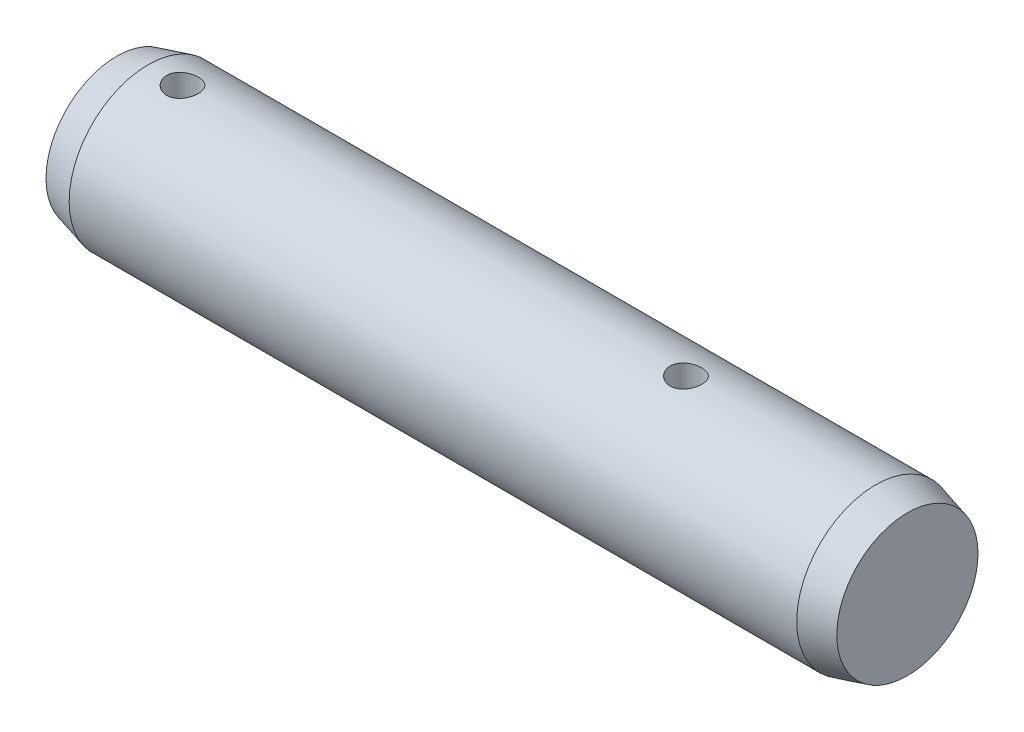
ISO-10303-21;
HEADER;
FILE_DESCRIPTION(('STEP AP214'),'2;1');
FILE_NAME('part.step','',(''),(''),'','','');
FILE_SCHEMA(('AUTOMOTIVE_DESIGN { 1 0 10303 214 1 1 1 1 }'));
ENDSEC;
DATA;
#1=APPLICATION_CONTEXT('core data for automotive mechanical design processes');
#2=APPLICATION_PROTOCOL_DEFINITION('international standard','automotive_design',2000,#1);
#3=PRODUCT_CONTEXT('',#1,'mechanical');
#4=PRODUCT('Part','Part','',(#3));
#5=PRODUCT_RELATED_PRODUCT_CATEGORY('part','',(#4));
#6=PRODUCT_DEFINITION_FORMATION('','',#4);
#7=PRODUCT_DEFINITION_CONTEXT('part definition',#1,'design');
#8=PRODUCT_DEFINITION('design','',#6,#7);
#9=PRODUCT_DEFINITION_SHAPE('','',#8);
#10=(LENGTH_UNIT() NAMED_UNIT(*) SI_UNIT(.MILLI.,.METRE.));
#11=(NAMED_UNIT(*) PLANE_ANGLE_UNIT() SI_UNIT($,.RADIAN.));
#12=(NAMED_UNIT(*) SI_UNIT($,.STERADIAN.) SOLID_ANGLE_UNIT());
#13=UNCERTAINTY_MEASURE_WITH_UNIT(LENGTH_MEASURE(1.E-05),#10,'distance_accuracy_value','');
#14=(GEOMETRIC_REPRESENTATION_CONTEXT(3) GLOBAL_UNCERTAINTY_ASSIGNED_CONTEXT((#13)) GLOBAL_UNIT_ASSIGNED_CONTEXT((#10,
#11,#12)) REPRESENTATION_CONTEXT('',''));
#15=CARTESIAN_POINT('',(0.,0.,0.));
#16=DIRECTION('',(0.,0.,1.));
#17=DIRECTION('',(1.,0.,0.));
#18=AXIS2_PLACEMENT_3D('',#15,#16,#17);
#19=CARTESIAN_POINT('',(-13.8,0.,0.));
#20=DIRECTION('',(1.,0.,0.));
#21=DIRECTION('',(0.,0.,-1.));
#22=AXIS2_PLACEMENT_3D('',#19,#20,#21);
#23=CYLINDRICAL_SURFACE('',#22,3.);
#24=CARTESIAN_POINT('',(6.6,-2.93938769133981,0.6));
#25=CARTESIAN_POINT('',(6.56666137471081,-2.93938835426359,0.599998767525627));
#26=CARTESIAN_POINT('',(6.5333072260161,-2.93996105008148,0.597211903034194));
#27=CARTESIAN_POINT('',(6.46754249692895,-2.94218658831158,0.586147370153001));
#28=CARTESIAN_POINT('',(6.43513269322136,-2.94384029499799,0.577865308242709));
#29=CARTESIAN_POINT('',(6.37221761798224,-2.94803324220213,0.556077469570642));
#30=CARTESIAN_POINT('',(6.34171048707904,-2.95057160169187,0.542576888491249));
#31=CARTESIAN_POINT('',(6.28339509318323,-2.95624679691852,0.510749464602625));
#32=CARTESIAN_POINT('',(6.25558667967763,-2.95938359925008,0.492422891160777));
#33=CARTESIAN_POINT('',(6.2030633976873,-2.96595179815608,0.451187445391973));
#34=CARTESIAN_POINT('',(6.17839224726951,-2.96938642702095,0.428223393547966));
#35=CARTESIAN_POINT('',(6.13322547985271,-2.97613483381812,0.378484073412809));
#36=CARTESIAN_POINT('',(6.11273015554971,-2.97944860326567,0.351708538186796));
#37=CARTESIAN_POINT('',(6.07632718942289,-2.98561677850468,0.294816813554547));
#38=CARTESIAN_POINT('',(6.06046109171001,-2.98846692864912,0.264673540603324));
#39=CARTESIAN_POINT('',(6.03403503777112,-2.99335042130197,0.202082490232364));
#40=CARTESIAN_POINT('',(6.0234745848594,-2.99538384026476,0.169634928852332));
#41=CARTESIAN_POINT('',(6.00809568382822,-2.99838192413046,0.103810063967096));
#42=CARTESIAN_POINT('',(6.00320341345739,-2.99936031772875,0.0704506435288881));
#43=CARTESIAN_POINT('',(5.99906942889701,-3.00018552710163,0.00337114106252173));
#44=CARTESIAN_POINT('',(5.9998271702125,-3.00003245191656,-0.030348905899106));
#45=CARTESIAN_POINT('',(6.00691570812933,-2.99862260921109,-0.0966852004461534));
#46=CARTESIAN_POINT('',(6.01316698630071,-2.99738159019503,-0.129310328579082));
#47=CARTESIAN_POINT('',(6.03093901947533,-2.99395306295645,-0.193038975948181));
#48=CARTESIAN_POINT('',(6.04245998531512,-2.99176551686423,-0.224142434248278));
#49=CARTESIAN_POINT('',(6.07051802408836,-2.98666377611975,-0.284171677920533));
#50=CARTESIAN_POINT('',(6.08708625066293,-2.98374508905134,-0.31308250448034));
#51=CARTESIAN_POINT('',(6.12474544634196,-2.97750281684271,-0.367743027515853));
#52=CARTESIAN_POINT('',(6.14583693586231,-2.97417918513133,-0.393492359715001));
#53=CARTESIAN_POINT('',(6.19238017326508,-2.96742578618676,-0.441570858632075));
#54=CARTESIAN_POINT('',(6.21790151203775,-2.96399517874509,-0.463832589944179));
#55=CARTESIAN_POINT('',(6.27234986547045,-2.95746942959256,-0.503771095906084));
#56=CARTESIAN_POINT('',(6.30127694452992,-2.95437429422729,-0.521447783836651));
#57=CARTESIAN_POINT('',(6.36181249909308,-2.94886828483754,-0.551737688881129));
#58=CARTESIAN_POINT('',(6.39342658058379,-2.94645888938129,-0.564339988666626));
#59=CARTESIAN_POINT('',(6.45838279423439,-2.94261885792763,-0.584034204976549));
#60=CARTESIAN_POINT('',(6.49172470057145,-2.94118809437056,-0.591126839673986));
#61=CARTESIAN_POINT('',(6.55857891479943,-2.93949287560696,-0.599499603621631));
#62=CARTESIAN_POINT('',(6.5920785445862,-2.93920888234292,-0.600877115338747));
#63=CARTESIAN_POINT('',(6.65882893391981,-2.93978691413312,-0.598042576986443));
#64=CARTESIAN_POINT('',(6.69207970747132,-2.94064887420233,-0.593830843873465));
#65=CARTESIAN_POINT('',(6.75706118417534,-2.94340339496949,-0.580021324844494));
#66=CARTESIAN_POINT('',(6.78880340582146,-2.94528599408698,-0.570475572503579));
#67=CARTESIAN_POINT('',(6.85023796741724,-2.94986093610999,-0.54632462118511));
#68=CARTESIAN_POINT('',(6.87993013826143,-2.95255334571762,-0.531719005423906));
#69=CARTESIAN_POINT('',(6.93684786597009,-2.95848843577223,-0.497642485329359));
#70=CARTESIAN_POINT('',(6.96403622778049,-2.96173783118942,-0.478110646789652));
#71=CARTESIAN_POINT('',(7.01478498720055,-2.96840234295982,-0.434817343327627));
#72=CARTESIAN_POINT('',(7.03834501094955,-2.97181747634291,-0.411055443086722));
#73=CARTESIAN_POINT('',(7.08153753551134,-2.97849207521529,-0.359539364098734));
#74=CARTESIAN_POINT('',(7.10110419278999,-2.9817483462521,-0.331729499357777));
#75=CARTESIAN_POINT('',(7.13528752889975,-2.98768276577172,-0.273160737980853));
#76=CARTESIAN_POINT('',(7.14990441560687,-2.99036093853126,-0.242401965260103));
#77=CARTESIAN_POINT('',(7.17367732304798,-2.9948237643664,-0.178981608494407));
#78=CARTESIAN_POINT('',(7.18286431093575,-2.99661347485562,-0.146332004086846));
#79=CARTESIAN_POINT('',(7.1956147485983,-2.99911941562596,-0.0799136728079467));
#80=CARTESIAN_POINT('',(7.19917887568541,-2.99983577519906,-0.0461450812267277));
#81=CARTESIAN_POINT('',(7.20055618857773,-3.00011124272472,0.0209237363421747));
#82=CARTESIAN_POINT('',(7.19846836827372,-2.9996902712961,0.054221887284902));
#83=CARTESIAN_POINT('',(7.18881962967131,-2.9977802613619,0.119982618789385));
#84=CARTESIAN_POINT('',(7.18125878019115,-2.99629123628611,0.152445209852215));
#85=CARTESIAN_POINT('',(7.16092260474501,-2.99241299019,0.215551649847058));
#86=CARTESIAN_POINT('',(7.14815917312129,-2.99002582348747,0.246199465944169));
#87=CARTESIAN_POINT('',(7.11779265520146,-2.98460833274029,0.304932732111572));
#88=CARTESIAN_POINT('',(7.10018918645777,-2.98157795787526,0.333017979460447));
#89=CARTESIAN_POINT('',(7.06030836776275,-2.97514559494721,0.386318334063815));
#90=CARTESIAN_POINT('',(7.03796019816794,-2.97173840053285,0.411479829669902));
#91=CARTESIAN_POINT('',(6.98936985594253,-2.96496733742173,0.457729570654108));
#92=CARTESIAN_POINT('',(6.96312676231875,-2.96160347917725,0.478816849921627));
#93=CARTESIAN_POINT('',(6.90715240997989,-2.95526005649978,0.51653533167312));
#94=CARTESIAN_POINT('',(6.87738662330378,-2.95228502178796,0.533116088783861));
#95=CARTESIAN_POINT('',(6.81544033602018,-2.94711142310667,0.561014429572685));
#96=CARTESIAN_POINT('',(6.78326205678125,-2.94491215522174,0.572336787587574));
#97=CARTESIAN_POINT('',(6.72584252673806,-2.94197808677353,0.587201483912564));
#98=CARTESIAN_POINT('',(6.70092874829312,-2.94101270949396,0.591992339113791));
#99=CARTESIAN_POINT('',(6.65067962726782,-2.93971727074818,0.598392010776246));
#100=CARTESIAN_POINT('',(6.62534429925109,-2.93938718737966,0.600000936937233));
#101=CARTESIAN_POINT('',(6.6,-2.93938769133981,0.6));
#102=B_SPLINE_CURVE_WITH_KNOTS('',3,(#24,#25,#26,#27,#28,#29,#30,#31,#32,#33,#34,#35,#36,#37,
#38,#39,#40,#41,#42,#43,#44,#45,#46,#47,#48,#49,#50,#51,#52,#53,#54,#55,#56,#57,#58,#59,#60,#61,
#62,#63,#64,#65,#66,#67,#68,#69,#70,#71,#72,#73,#74,#75,#76,#77,#78,#79,#80,#81,#82,#83,#84,#85,
#86,#87,#88,#89,#90,#91,#92,#93,#94,#95,#96,#97,#98,#99,#100,#101),.UNSPECIFIED.,.T.,.F.,(4,2,2,
2,2,2,2,2,2,2,2,2,2,2,2,2,2,2,2,2,2,2,2,2,2,2,2,2,2,2,2,2,2,2,2,2,2,2,4),(0.,0.0999230783139148,
0.199926143555559,0.299829898749334,0.3997280789009,0.500893515275603,0.602066040197513,
0.704120402609683,0.80616520946434,0.906865493283464,1.00755607268247,1.10681273778621,
1.20607337442748,1.3059595453188,1.40585721460538,1.50749608055988,1.6091368687213,
1.71099517902164,1.81284021008113,1.91294254681254,2.01303920715551,2.11217605068489,
2.21132106211137,2.31175835863211,2.41220599720624,2.51419561038569,2.61618093976561,
2.71757888145688,2.81896460813475,2.9185861044731,3.01820634818552,3.11760010243769,
3.21700171279309,3.31800691213856,3.41903603332367,3.52115339145923,3.62317785051858,
3.69914282180636,3.77510517409027),.UNSPECIFIED.);
#103=CARTESIAN_POINT('',(6.6,-2.93938769133981,0.6));
#104=VERTEX_POINT('',#103);
#105=EDGE_CURVE('E45',#104,#104,#102,.T.);
#106=ORIENTED_EDGE('',*,*,#105,.F.);
#107=EDGE_LOOP('',(#106));
#108=FACE_BOUND('',#107,.T.);
#109=CARTESIAN_POINT('',(6.6,2.93938769133981,0.6));
#110=CARTESIAN_POINT('',(6.63333862528918,2.93938835426359,0.599998767525627));
#111=CARTESIAN_POINT('',(6.66669277398389,2.93996105008148,0.597211903034194));
#112=CARTESIAN_POINT('',(6.73245750307104,2.94218658831158,0.586147370153001));
#113=CARTESIAN_POINT('',(6.76486730677864,2.94384029499799,0.577865308242709));
#114=CARTESIAN_POINT('',(6.82778238201776,2.94803324220213,0.556077469570643));
#115=CARTESIAN_POINT('',(6.85828951292095,2.95057160169187,0.54257688849125));
#116=CARTESIAN_POINT('',(6.91660490681677,2.95624679691852,0.510749464602626));
#117=CARTESIAN_POINT('',(6.94441332032236,2.95938359925008,0.492422891160777));
#118=CARTESIAN_POINT('',(6.9969366023127,2.96595179815608,0.451187445391973));
#119=CARTESIAN_POINT('',(7.02160775273048,2.96938642702095,0.428223393547967));
#120=CARTESIAN_POINT('',(7.06677452014728,2.97613483381812,0.378484073412809));
#121=CARTESIAN_POINT('',(7.08726984445029,2.97944860326567,0.351708538186797));
#122=CARTESIAN_POINT('',(7.1236728105771,2.98561677850468,0.294816813554547));
#123=CARTESIAN_POINT('',(7.13953890828999,2.98846692864912,0.264673540603324));
#124=CARTESIAN_POINT('',(7.16596496222887,2.99335042130197,0.202082490232364));
#125=CARTESIAN_POINT('',(7.17652541514059,2.99538384026476,0.169634928852332));
#126=CARTESIAN_POINT('',(7.19190431617177,2.99838192413046,0.103810063967096));
#127=CARTESIAN_POINT('',(7.1967965865426,2.99936031772875,0.0704506435288881));
#128=CARTESIAN_POINT('',(7.20093057110299,3.00018552710163,0.0033711410625217));
#129=CARTESIAN_POINT('',(7.20017282978749,3.00003245191656,-0.030348905899106));
#130=CARTESIAN_POINT('',(7.19308429187067,2.99862260921109,-0.0966852004461534));
#131=CARTESIAN_POINT('',(7.18683301369929,2.99738159019503,-0.129310328579082));
#132=CARTESIAN_POINT('',(7.16906098052466,2.99395306295645,-0.193038975948181));
#133=CARTESIAN_POINT('',(7.15754001468487,2.99176551686423,-0.224142434248278));
#134=CARTESIAN_POINT('',(7.12948197591164,2.98666377611975,-0.284171677920533));
#135=CARTESIAN_POINT('',(7.11291374933707,2.98374508905134,-0.31308250448034));
#136=CARTESIAN_POINT('',(7.07525455365804,2.97750281684271,-0.367743027515853));
#137=CARTESIAN_POINT('',(7.05416306413769,2.97417918513133,-0.393492359715001));
#138=CARTESIAN_POINT('',(7.00761982673491,2.96742578618676,-0.441570858632075));
#139=CARTESIAN_POINT('',(6.98209848796224,2.96399517874509,-0.463832589944179));
#140=CARTESIAN_POINT('',(6.92765013452955,2.95746942959256,-0.503771095906084));
#141=CARTESIAN_POINT('',(6.89872305547008,2.95437429422729,-0.521447783836651));
#142=CARTESIAN_POINT('',(6.83818750090691,2.94886828483754,-0.551737688881129));
#143=CARTESIAN_POINT('',(6.8065734194162,2.94645888938129,-0.564339988666626));
#144=CARTESIAN_POINT('',(6.7416172057656,2.94261885792763,-0.584034204976549));
#145=CARTESIAN_POINT('',(6.70827529942855,2.94118809437056,-0.591126839673986));
#146=CARTESIAN_POINT('',(6.64142108520057,2.93949287560696,-0.599499603621631));
#147=CARTESIAN_POINT('',(6.60792145541379,2.93920888234292,-0.600877115338747));
#148=CARTESIAN_POINT('',(6.54117106608019,2.93978691413312,-0.598042576986443));
#149=CARTESIAN_POINT('',(6.50792029252868,2.94064887420233,-0.593830843873465));
#150=CARTESIAN_POINT('',(6.44293881582466,2.94340339496949,-0.580021324844494));
#151=CARTESIAN_POINT('',(6.41119659417854,2.94528599408698,-0.570475572503579));
#152=CARTESIAN_POINT('',(6.34976203258275,2.94986093610999,-0.546324621185111));
#153=CARTESIAN_POINT('',(6.32006986173857,2.95255334571762,-0.531719005423906));
#154=CARTESIAN_POINT('',(6.2631521340299,2.95848843577223,-0.497642485329359));
#155=CARTESIAN_POINT('',(6.2359637722195,2.96173783118942,-0.478110646789652));
#156=CARTESIAN_POINT('',(6.18521501279945,2.96840234295982,-0.434817343327627));
#157=CARTESIAN_POINT('',(6.16165498905044,2.97181747634291,-0.411055443086722));
#158=CARTESIAN_POINT('',(6.11846246448865,2.97849207521529,-0.359539364098734));
#159=CARTESIAN_POINT('',(6.09889580721,2.9817483462521,-0.331729499357777));
#160=CARTESIAN_POINT('',(6.06471247110025,2.98768276577172,-0.273160737980853));
#161=CARTESIAN_POINT('',(6.05009558439313,2.99036093853126,-0.242401965260103));
#162=CARTESIAN_POINT('',(6.02632267695202,2.9948237643664,-0.178981608494407));
#163=CARTESIAN_POINT('',(6.01713568906425,2.99661347485562,-0.146332004086846));
#164=CARTESIAN_POINT('',(6.00438525140169,2.99911941562596,-0.0799136728079467));
#165=CARTESIAN_POINT('',(6.00082112431459,2.99983577519906,-0.0461450812267277));
#166=CARTESIAN_POINT('',(5.99944381142227,3.00011124272472,0.0209237363421747));
#167=CARTESIAN_POINT('',(6.00153163172627,2.9996902712961,0.054221887284902));
#168=CARTESIAN_POINT('',(6.01118037032868,2.9977802613619,0.119982618789385));
#169=CARTESIAN_POINT('',(6.01874121980884,2.99629123628611,0.152445209852215));
#170=CARTESIAN_POINT('',(6.03907739525498,2.99241299019,0.215551649847058));
#171=CARTESIAN_POINT('',(6.05184082687871,2.99002582348747,0.246199465944169));
#172=CARTESIAN_POINT('',(6.08220734479854,2.98460833274029,0.304932732111572));
#173=CARTESIAN_POINT('',(6.09981081354223,2.98157795787526,0.333017979460447));
#174=CARTESIAN_POINT('',(6.13969163223725,2.97514559494721,0.386318334063815));
#175=CARTESIAN_POINT('',(6.16203980183206,2.97173840053285,0.411479829669903));
#176=CARTESIAN_POINT('',(6.21063014405746,2.96496733742173,0.457729570654108));
#177=CARTESIAN_POINT('',(6.23687323768124,2.96160347917725,0.478816849921628));
#178=CARTESIAN_POINT('',(6.2928475900201,2.95526005649978,0.51653533167312));
#179=CARTESIAN_POINT('',(6.32261337669622,2.95228502178796,0.533116088783861));
#180=CARTESIAN_POINT('',(6.38455966397981,2.94711142310667,0.561014429572685));
#181=CARTESIAN_POINT('',(6.41673794321875,2.94491215522174,0.572336787587574));
#182=CARTESIAN_POINT('',(6.47415747326194,2.94197808677353,0.587201483912564));
#183=CARTESIAN_POINT('',(6.49907125170687,2.94101270949396,0.591992339113791));
#184=CARTESIAN_POINT('',(6.54932037273218,2.93971727074818,0.598392010776246));
#185=CARTESIAN_POINT('',(6.5746557007489,2.93938718737966,0.600000936937233));
#186=CARTESIAN_POINT('',(6.6,2.93938769133981,0.6));
#187=B_SPLINE_CURVE_WITH_KNOTS('',3,(#109,#110,#111,#112,#113,#114,#115,#116,#117,#118,#119,
#120,#121,#122,#123,#124,#125,#126,#127,#128,#129,#130,#131,#132,#133,#134,#135,#136,#137,#138,
#139,#140,#141,#142,#143,#144,#145,#146,#147,#148,#149,#150,#151,#152,#153,#154,#155,#156,#157,
#158,#159,#160,#161,#162,#163,#164,#165,#166,#167,#168,#169,#170,#171,#172,#173,#174,#175,#176,
#177,#178,#179,#180,#181,#182,#183,#184,#185,#186),.UNSPECIFIED.,.T.,.F.,(4,2,2,2,2,2,2,2,2,2,2,
2,2,2,2,2,2,2,2,2,2,2,2,2,2,2,2,2,2,2,2,2,2,2,2,2,2,2,4),(0.,0.0999230783139148,
0.199926143555559,0.299829898749332,0.3997280789009,0.500893515275601,0.602066040197513,
0.704120402609683,0.80616520946434,0.906865493283464,1.00755607268247,1.10681273778621,
1.20607337442748,1.3059595453188,1.40585721460538,1.50749608055988,1.6091368687213,
1.71099517902164,1.81284021008113,1.91294254681254,2.01303920715551,2.11217605068489,
2.21132106211137,2.31175835863211,2.41220599720623,2.51419561038569,2.61618093976561,
2.71757888145688,2.81896460813475,2.9185861044731,3.01820634818552,3.11760010243769,
3.21700171279309,3.31800691213856,3.41903603332367,3.52115339145923,3.62317785051858,
3.69914282180636,3.77510517409027),.UNSPECIFIED.);
#188=CARTESIAN_POINT('',(6.6,2.93938769133981,0.6));
#189=VERTEX_POINT('',#188);
#190=EDGE_CURVE('E111',#189,#189,#187,.T.);
#191=ORIENTED_EDGE('',*,*,#190,.F.);
#192=EDGE_LOOP('',(#191));
#193=FACE_BOUND('',#192,.T.);
#194=CARTESIAN_POINT('',(-12.5,-2.93938769133981,0.6));
#195=CARTESIAN_POINT('',(-12.5333386252892,-2.93938835426359,0.599998767525627));
#196=CARTESIAN_POINT('',(-12.5666927739839,-2.93996105008148,0.597211903034194));
#197=CARTESIAN_POINT('',(-12.632457503071,-2.94218658831158,0.586147370153001));
#198=CARTESIAN_POINT('',(-12.6648673067786,-2.94384029499799,0.577865308242709));
#199=CARTESIAN_POINT('',(-12.7277823820178,-2.94803324220213,0.556077469570643));
#200=CARTESIAN_POINT('',(-12.758289512921,-2.95057160169187,0.54257688849125));
#201=CARTESIAN_POINT('',(-12.8166049068168,-2.95624679691852,0.510749464602627));
#202=CARTESIAN_POINT('',(-12.8444133203224,-2.95938359925008,0.492422891160779));
#203=CARTESIAN_POINT('',(-12.8969366023127,-2.96595179815608,0.451187445391975));
#204=CARTESIAN_POINT('',(-12.9216077527305,-2.96938642702095,0.428223393547968));
#205=CARTESIAN_POINT('',(-12.9667745201473,-2.97613483381812,0.37848407341281));
#206=CARTESIAN_POINT('',(-12.9872698444503,-2.97944860326567,0.351708538186797));
#207=CARTESIAN_POINT('',(-13.0236728105771,-2.98561677850468,0.294816813554547));
#208=CARTESIAN_POINT('',(-13.03953890829,-2.98846692864912,0.264673540603325));
#209=CARTESIAN_POINT('',(-13.0659649622289,-2.99335042130197,0.202082490232365));
#210=CARTESIAN_POINT('',(-13.0765254151406,-2.99538384026476,0.169634928852332));
#211=CARTESIAN_POINT('',(-13.0919043161718,-2.99838192413046,0.103810063967096));
#212=CARTESIAN_POINT('',(-13.0967965865426,-2.99936031772875,0.0704506435288885));
#213=CARTESIAN_POINT('',(-13.100930571103,-3.00018552710163,0.0033711410625223));
#214=CARTESIAN_POINT('',(-13.1001728297875,-3.00003245191656,-0.0303489058991053));
#215=CARTESIAN_POINT('',(-13.0930842918707,-2.99862260921109,-0.0966852004461526));
#216=CARTESIAN_POINT('',(-13.0868330136993,-2.99738159019503,-0.129310328579082));
#217=CARTESIAN_POINT('',(-13.0690609805247,-2.99395306295645,-0.19303897594818));
#218=CARTESIAN_POINT('',(-13.0575400146849,-2.99176551686423,-0.224142434248277));
#219=CARTESIAN_POINT('',(-13.0294819759116,-2.98666377611975,-0.284171677920532));
#220=CARTESIAN_POINT('',(-13.0129137493371,-2.98374508905134,-0.31308250448034));
#221=CARTESIAN_POINT('',(-12.975254553658,-2.97750281684271,-0.367743027515854));
#222=CARTESIAN_POINT('',(-12.9541630641377,-2.97417918513133,-0.393492359715));
#223=CARTESIAN_POINT('',(-12.9076198267349,-2.96742578618676,-0.441570858632074));
#224=CARTESIAN_POINT('',(-12.8820984879622,-2.96399517874509,-0.463832589944178));
#225=CARTESIAN_POINT('',(-12.8276501345295,-2.95746942959256,-0.503771095906084));
#226=CARTESIAN_POINT('',(-12.7987230554701,-2.95437429422729,-0.52144778383665));
#227=CARTESIAN_POINT('',(-12.7381875009069,-2.94886828483754,-0.551737688881129));
#228=CARTESIAN_POINT('',(-12.7065734194162,-2.94645888938129,-0.564339988666626));
#229=CARTESIAN_POINT('',(-12.6416172057656,-2.94261885792763,-0.584034204976549));
#230=CARTESIAN_POINT('',(-12.6082752994285,-2.94118809437056,-0.591126839673985));
#231=CARTESIAN_POINT('',(-12.5414210852006,-2.93949287560696,-0.599499603621631));
#232=CARTESIAN_POINT('',(-12.5079214554138,-2.93920888234292,-0.600877115338747));
#233=CARTESIAN_POINT('',(-12.4411710660802,-2.93978691413312,-0.598042576986443));
#234=CARTESIAN_POINT('',(-12.4079202925287,-2.94064887420233,-0.593830843873466));
#235=CARTESIAN_POINT('',(-12.3429388158247,-2.94340339496949,-0.580021324844494));
#236=CARTESIAN_POINT('',(-12.3111965941785,-2.94528599408698,-0.570475572503579));
#237=CARTESIAN_POINT('',(-12.2497620325828,-2.94986093610999,-0.54632462118511));
#238=CARTESIAN_POINT('',(-12.2200698617386,-2.95255334571762,-0.531719005423906));
#239=CARTESIAN_POINT('',(-12.1631521340299,-2.95848843577223,-0.497642485329359));
#240=CARTESIAN_POINT('',(-12.1359637722195,-2.96173783118942,-0.478110646789652));
#241=CARTESIAN_POINT('',(-12.0852150127994,-2.96840234295982,-0.434817343327627));
#242=CARTESIAN_POINT('',(-12.0616549890504,-2.97181747634291,-0.411055443086722));
#243=CARTESIAN_POINT('',(-12.0184624644887,-2.97849207521529,-0.359539364098734));
#244=CARTESIAN_POINT('',(-11.99889580721,-2.9817483462521,-0.331729499357777));
#245=CARTESIAN_POINT('',(-11.9647124711002,-2.98768276577172,-0.273160737980853));
#246=CARTESIAN_POINT('',(-11.9500955843931,-2.99036093853126,-0.242401965260104));
#247=CARTESIAN_POINT('',(-11.926322676952,-2.9948237643664,-0.178981608494408));
#248=CARTESIAN_POINT('',(-11.9171356890642,-2.99661347485562,-0.146332004086847));
#249=CARTESIAN_POINT('',(-11.9043852514017,-2.99911941562596,-0.0799136728079481));
#250=CARTESIAN_POINT('',(-11.9008211243146,-2.99983577519906,-0.0461450812267291));
#251=CARTESIAN_POINT('',(-11.8994438114223,-3.00011124272472,0.0209237363421737));
#252=CARTESIAN_POINT('',(-11.9015316317263,-2.9996902712961,0.0542218872849012));
#253=CARTESIAN_POINT('',(-11.9111803703287,-2.9977802613619,0.119982618789385));
#254=CARTESIAN_POINT('',(-11.9187412198088,-2.99629123628611,0.152445209852214));
#255=CARTESIAN_POINT('',(-11.939077395255,-2.99241299019,0.215551649847057));
#256=CARTESIAN_POINT('',(-11.9518408268787,-2.99002582348747,0.246199465944168));
#257=CARTESIAN_POINT('',(-11.9822073447985,-2.98460833274029,0.304932732111571));
#258=CARTESIAN_POINT('',(-11.9998108135422,-2.98157795787526,0.333017979460446));
#259=CARTESIAN_POINT('',(-12.0396916322372,-2.97514559494721,0.386318334063814));
#260=CARTESIAN_POINT('',(-12.0620398018321,-2.97173840053285,0.411479829669902));
#261=CARTESIAN_POINT('',(-12.1106301440575,-2.96496733742173,0.457729570654107));
#262=CARTESIAN_POINT('',(-12.1368732376812,-2.96160347917725,0.478816849921627));
#263=CARTESIAN_POINT('',(-12.1928475900201,-2.95526005649978,0.51653533167312));
#264=CARTESIAN_POINT('',(-12.2226133766962,-2.95228502178797,0.53311608878386));
#265=CARTESIAN_POINT('',(-12.2845596639798,-2.94711142310667,0.561014429572686));
#266=CARTESIAN_POINT('',(-12.3167379432187,-2.94491215522174,0.572336787587574));
#267=CARTESIAN_POINT('',(-12.3741574732619,-2.94197808677353,0.587201483912564));
#268=CARTESIAN_POINT('',(-12.3990712517069,-2.94101270949396,0.591992339113792));
#269=CARTESIAN_POINT('',(-12.4493203727322,-2.93971727074818,0.598392010776246));
#270=CARTESIAN_POINT('',(-12.4746557007489,-2.93938718737966,0.600000936937233));
#271=CARTESIAN_POINT('',(-12.5,-2.93938769133981,0.6));
#272=B_SPLINE_CURVE_WITH_KNOTS('',3,(#194,#195,#196,#197,#198,#199,#200,#201,#202,#203,#204,
#205,#206,#207,#208,#209,#210,#211,#212,#213,#214,#215,#216,#217,#218,#219,#220,#221,#222,#223,
#224,#225,#226,#227,#228,#229,#230,#231,#232,#233,#234,#235,#236,#237,#238,#239,#240,#241,#242,
#243,#244,#245,#246,#247,#248,#249,#250,#251,#252,#253,#254,#255,#256,#257,#258,#259,#260,#261,
#262,#263,#264,#265,#266,#267,#268,#269,#270,#271),.UNSPECIFIED.,.T.,.F.,(4,2,2,2,2,2,2,2,2,2,2,
2,2,2,2,2,2,2,2,2,2,2,2,2,2,2,2,2,2,2,2,2,2,2,2,2,2,2,4),(0.,0.099923078313913,
0.199926143555558,0.299829898749331,0.399728078900897,0.5008935152756,0.602066040197513,
0.704120402609682,0.80616520946434,0.906865493283463,1.00755607268247,1.10681273778621,
1.20607337442748,1.3059595453188,1.40585721460538,1.50749608055988,1.6091368687213,
1.71099517902164,1.81284021008113,1.91294254681255,2.01303920715551,2.1121760506849,
2.21132106211137,2.31175835863211,2.41220599720623,2.51419561038569,2.61618093976561,
2.71757888145688,2.81896460813475,2.9185861044731,3.01820634818552,3.11760010243769,
3.21700171279309,3.31800691213856,3.41903603332367,3.52115339145923,3.62317785051858,
3.69914282180636,3.77510517409027),.UNSPECIFIED.);
#273=CARTESIAN_POINT('',(-12.5,-2.93938769133981,0.6));
#274=VERTEX_POINT('',#273);
#275=EDGE_CURVE('E72',#274,#274,#272,.T.);
#276=ORIENTED_EDGE('',*,*,#275,.F.);
#277=EDGE_LOOP('',(#276));
#278=FACE_BOUND('',#277,.T.);
#279=CARTESIAN_POINT('',(-12.5,2.93938769133981,0.6));
#280=CARTESIAN_POINT('',(-12.4666613747108,2.93938835426359,0.599998767525627));
#281=CARTESIAN_POINT('',(-12.4333072260161,2.93996105008148,0.597211903034194));
#282=CARTESIAN_POINT('',(-12.367542496929,2.94218658831158,0.586147370153001));
#283=CARTESIAN_POINT('',(-12.3351326932214,2.94384029499799,0.577865308242709));
#284=CARTESIAN_POINT('',(-12.2722176179822,2.94803324220213,0.556077469570643));
#285=CARTESIAN_POINT('',(-12.241710487079,2.95057160169187,0.54257688849125));
#286=CARTESIAN_POINT('',(-12.1833950931832,2.95624679691852,0.510749464602627));
#287=CARTESIAN_POINT('',(-12.1555866796776,2.95938359925008,0.492422891160779));
#288=CARTESIAN_POINT('',(-12.1030633976873,2.96595179815608,0.451187445391975));
#289=CARTESIAN_POINT('',(-12.0783922472695,2.96938642702095,0.428223393547968));
#290=CARTESIAN_POINT('',(-12.0332254798527,2.97613483381812,0.37848407341281));
#291=CARTESIAN_POINT('',(-12.0127301555497,2.97944860326567,0.351708538186797));
#292=CARTESIAN_POINT('',(-11.9763271894229,2.98561677850468,0.294816813554547));
#293=CARTESIAN_POINT('',(-11.96046109171,2.98846692864912,0.264673540603325));
#294=CARTESIAN_POINT('',(-11.9340350377711,2.99335042130197,0.202082490232365));
#295=CARTESIAN_POINT('',(-11.9234745848594,2.99538384026476,0.169634928852332));
#296=CARTESIAN_POINT('',(-11.9080956838282,2.99838192413046,0.103810063967096));
#297=CARTESIAN_POINT('',(-11.9032034134574,2.99936031772875,0.0704506435288885));
#298=CARTESIAN_POINT('',(-11.899069428897,3.00018552710163,0.0033711410625223));
#299=CARTESIAN_POINT('',(-11.8998271702125,3.00003245191656,-0.0303489058991053));
#300=CARTESIAN_POINT('',(-11.9069157081293,2.99862260921109,-0.0966852004461525));
#301=CARTESIAN_POINT('',(-11.9131669863007,2.99738159019503,-0.129310328579081));
#302=CARTESIAN_POINT('',(-11.9309390194753,2.99395306295645,-0.19303897594818));
#303=CARTESIAN_POINT('',(-11.9424599853151,2.99176551686423,-0.224142434248277));
#304=CARTESIAN_POINT('',(-11.9705180240884,2.98666377611975,-0.284171677920532));
#305=CARTESIAN_POINT('',(-11.9870862506629,2.98374508905134,-0.31308250448034));
#306=CARTESIAN_POINT('',(-12.024745446342,2.97750281684271,-0.367743027515854));
#307=CARTESIAN_POINT('',(-12.0458369358623,2.97417918513133,-0.393492359715));
#308=CARTESIAN_POINT('',(-12.0923801732651,2.96742578618676,-0.441570858632074));
#309=CARTESIAN_POINT('',(-12.1179015120378,2.96399517874509,-0.463832589944178));
#310=CARTESIAN_POINT('',(-12.1723498654704,2.95746942959256,-0.503771095906084));
#311=CARTESIAN_POINT('',(-12.2012769445299,2.95437429422729,-0.52144778383665));
#312=CARTESIAN_POINT('',(-12.2618124990931,2.94886828483754,-0.551737688881129));
#313=CARTESIAN_POINT('',(-12.2934265805838,2.94645888938129,-0.564339988666626));
#314=CARTESIAN_POINT('',(-12.3583827942344,2.94261885792763,-0.584034204976549));
#315=CARTESIAN_POINT('',(-12.3917247005714,2.94118809437056,-0.591126839673985));
#316=CARTESIAN_POINT('',(-12.4585789147994,2.93949287560696,-0.599499603621631));
#317=CARTESIAN_POINT('',(-12.4920785445862,2.93920888234292,-0.600877115338747));
#318=CARTESIAN_POINT('',(-12.5588289339198,2.93978691413312,-0.598042576986443));
#319=CARTESIAN_POINT('',(-12.5920797074713,2.94064887420233,-0.593830843873466));
#320=CARTESIAN_POINT('',(-12.6570611841753,2.94340339496949,-0.580021324844494));
#321=CARTESIAN_POINT('',(-12.6888034058215,2.94528599408698,-0.570475572503579));
#322=CARTESIAN_POINT('',(-12.7502379674172,2.94986093610999,-0.54632462118511));
#323=CARTESIAN_POINT('',(-12.7799301382614,2.95255334571762,-0.531719005423906));
#324=CARTESIAN_POINT('',(-12.8368478659701,2.95848843577223,-0.497642485329359));
#325=CARTESIAN_POINT('',(-12.8640362277805,2.96173783118942,-0.478110646789652));
#326=CARTESIAN_POINT('',(-12.9147849872005,2.96840234295982,-0.434817343327627));
#327=CARTESIAN_POINT('',(-12.9383450109496,2.97181747634291,-0.411055443086722));
#328=CARTESIAN_POINT('',(-12.9815375355113,2.97849207521529,-0.359539364098735));
#329=CARTESIAN_POINT('',(-13.00110419279,2.9817483462521,-0.331729499357778));
#330=CARTESIAN_POINT('',(-13.0352875288997,2.98768276577172,-0.273160737980853));
#331=CARTESIAN_POINT('',(-13.0499044156069,2.99036093853126,-0.242401965260104));
#332=CARTESIAN_POINT('',(-13.073677323048,2.9948237643664,-0.178981608494407));
#333=CARTESIAN_POINT('',(-13.0828643109357,2.99661347485562,-0.146332004086846));
#334=CARTESIAN_POINT('',(-13.0956147485983,2.99911941562596,-0.0799136728079475));
#335=CARTESIAN_POINT('',(-13.0991788756854,2.99983577519906,-0.0461450812267287));
#336=CARTESIAN_POINT('',(-13.1005561885777,3.00011124272472,0.0209237363421736));
#337=CARTESIAN_POINT('',(-13.0984683682737,2.9996902712961,0.054221887284901));
#338=CARTESIAN_POINT('',(-13.0888196296713,2.9977802613619,0.119982618789385));
#339=CARTESIAN_POINT('',(-13.0812587801912,2.99629123628611,0.152445209852214));
#340=CARTESIAN_POINT('',(-13.060922604745,2.99241299019,0.215551649847058));
#341=CARTESIAN_POINT('',(-13.0481591731213,2.99002582348747,0.246199465944169));
#342=CARTESIAN_POINT('',(-13.0177926552015,2.98460833274029,0.304932732111572));
#343=CARTESIAN_POINT('',(-13.0001891864578,2.98157795787526,0.333017979460447));
#344=CARTESIAN_POINT('',(-12.9603083677627,2.97514559494721,0.386318334063814));
#345=CARTESIAN_POINT('',(-12.9379601981679,2.97173840053285,0.411479829669902));
#346=CARTESIAN_POINT('',(-12.8893698559425,2.96496733742173,0.457729570654107));
#347=CARTESIAN_POINT('',(-12.8631267623188,2.96160347917725,0.478816849921627));
#348=CARTESIAN_POINT('',(-12.8071524099799,2.95526005649978,0.51653533167312));
#349=CARTESIAN_POINT('',(-12.7773866233038,2.95228502178797,0.53311608878386));
#350=CARTESIAN_POINT('',(-12.7154403360202,2.94711142310667,0.561014429572686));
#351=CARTESIAN_POINT('',(-12.6832620567812,2.94491215522174,0.572336787587574));
#352=CARTESIAN_POINT('',(-12.6258425267381,2.94197808677353,0.587201483912564));
#353=CARTESIAN_POINT('',(-12.6009287482931,2.94101270949396,0.591992339113792));
#354=CARTESIAN_POINT('',(-12.5506796272678,2.93971727074818,0.598392010776246));
#355=CARTESIAN_POINT('',(-12.5253442992511,2.93938718737966,0.600000936937233));
#356=CARTESIAN_POINT('',(-12.5,2.93938769133981,0.6));
#357=B_SPLINE_CURVE_WITH_KNOTS('',3,(#279,#280,#281,#282,#283,#284,#285,#286,#287,#288,#289,
#290,#291,#292,#293,#294,#295,#296,#297,#298,#299,#300,#301,#302,#303,#304,#305,#306,#307,#308,
#309,#310,#311,#312,#313,#314,#315,#316,#317,#318,#319,#320,#321,#322,#323,#324,#325,#326,#327,
#328,#329,#330,#331,#332,#333,#334,#335,#336,#337,#338,#339,#340,#341,#342,#343,#344,#345,#346,
#347,#348,#349,#350,#351,#352,#353,#354,#355,#356),.UNSPECIFIED.,.T.,.F.,(4,2,2,2,2,2,2,2,2,2,2,
2,2,2,2,2,2,2,2,2,2,2,2,2,2,2,2,2,2,2,2,2,2,2,2,2,2,2,4),(0.,0.099923078313913,
0.199926143555558,0.299829898749331,0.399728078900897,0.5008935152756,0.602066040197513,
0.704120402609682,0.80616520946434,0.906865493283463,1.00755607268247,1.1068127377862,
1.20607337442748,1.3059595453188,1.40585721460538,1.50749608055988,1.6091368687213,
1.71099517902164,1.81284021008113,1.91294254681255,2.01303920715551,2.1121760506849,
2.21132106211137,2.31175835863211,2.41220599720623,2.51419561038569,2.61618093976561,
2.71757888145688,2.81896460813475,2.9185861044731,3.01820634818552,3.11760010243769,
3.21700171279309,3.31800691213856,3.41903603332367,3.52115339145923,3.62317785051858,
3.69914282180636,3.77510517409027),.UNSPECIFIED.);
#358=CARTESIAN_POINT('',(-12.5,2.93938769133981,0.6));
#359=VERTEX_POINT('',#358);
#360=EDGE_CURVE('E64',#359,#359,#357,.T.);
#361=ORIENTED_EDGE('',*,*,#360,.F.);
#362=EDGE_LOOP('',(#361));
#363=FACE_BOUND('',#362,.T.);
#364=CARTESIAN_POINT('',(-13.8,0.,0.));
#365=DIRECTION('',(-1.,0.,0.));
#366=DIRECTION('',(0.,0.,1.));
#367=AXIS2_PLACEMENT_3D('',#364,#365,#366);
#368=CIRCLE('',#367,3.);
#369=CARTESIAN_POINT('',(-13.8,0.,3.));
#370=VERTEX_POINT('',#369);
#371=EDGE_CURVE('E120',#370,#370,#368,.T.);
#372=ORIENTED_EDGE('',*,*,#371,.F.);
#373=EDGE_LOOP('',(#372));
#374=FACE_BOUND('',#373,.T.);
#375=CARTESIAN_POINT('',(13.8,0.,0.));
#376=DIRECTION('',(1.,0.,0.));
#377=DIRECTION('',(0.,0.,-1.));
#378=AXIS2_PLACEMENT_3D('',#375,#376,#377);
#379=CIRCLE('',#378,3.);
#380=CARTESIAN_POINT('',(13.8,0.,-3.));
#381=VERTEX_POINT('',#380);
#382=EDGE_CURVE('E10',#381,#381,#379,.T.);
#383=ORIENTED_EDGE('',*,*,#382,.F.);
#384=EDGE_LOOP('',(#383));
#385=FACE_BOUND('',#384,.T.);
#386=ADVANCED_FACE('F41',(#108,#193,#278,#363,#374,#385),#23,.T.);
#387=CARTESIAN_POINT('',(13.8,0.,0.));
#388=DIRECTION('',(-1.,0.,0.));
#389=DIRECTION('',(0.,0.,-1.));
#390=AXIS2_PLACEMENT_3D('',#387,#388,#389);
#391=CONICAL_SURFACE('',#390,3.,0.26179938779915);
#392=CARTESIAN_POINT('',(15.,0.,0.));
#393=DIRECTION('',(1.,0.,0.));
#394=DIRECTION('',(0.,0.,-1.));
#395=AXIS2_PLACEMENT_3D('',#392,#393,#394);
#396=CIRCLE('',#395,2.67846096908265);
#397=CARTESIAN_POINT('',(15.,0.,-2.67846096908265));
#398=VERTEX_POINT('',#397);
#399=EDGE_CURVE('E54',#398,#398,#396,.T.);
#400=ORIENTED_EDGE('',*,*,#399,.F.);
#401=EDGE_LOOP('',(#400));
#402=FACE_BOUND('',#401,.T.);
#403=ORIENTED_EDGE('',*,*,#382,.T.);
#404=EDGE_LOOP('',(#403));
#405=FACE_BOUND('',#404,.T.);
#406=ADVANCED_FACE('F94',(#402,#405),#391,.T.);
#407=CARTESIAN_POINT('',(15.,0.,0.));
#408=DIRECTION('',(1.,0.,0.));
#409=DIRECTION('',(0.,0.,-1.));
#410=AXIS2_PLACEMENT_3D('',#407,#408,#409);
#411=PLANE('',#410);
#412=ORIENTED_EDGE('',*,*,#399,.T.);
#413=EDGE_LOOP('',(#412));
#414=FACE_BOUND('',#413,.T.);
#415=ADVANCED_FACE('F91',(#414),#411,.T.);
#416=CARTESIAN_POINT('',(-13.8,0.,0.));
#417=DIRECTION('',(1.,0.,0.));
#418=DIRECTION('',(0.,0.,1.));
#419=AXIS2_PLACEMENT_3D('',#416,#417,#418);
#420=CONICAL_SURFACE('',#419,3.,0.26179938779915);
#421=CARTESIAN_POINT('',(-15.,0.,0.));
#422=DIRECTION('',(-1.,0.,0.));
#423=DIRECTION('',(0.,0.,1.));
#424=AXIS2_PLACEMENT_3D('',#421,#422,#423);
#425=CIRCLE('',#424,2.67846096908265);
#426=CARTESIAN_POINT('',(-15.,0.,2.67846096908265));
#427=VERTEX_POINT('',#426);
#428=EDGE_CURVE('E60',#427,#427,#425,.T.);
#429=ORIENTED_EDGE('',*,*,#428,.F.);
#430=EDGE_LOOP('',(#429));
#431=FACE_BOUND('',#430,.T.);
#432=ORIENTED_EDGE('',*,*,#371,.T.);
#433=EDGE_LOOP('',(#432));
#434=FACE_BOUND('',#433,.T.);
#435=ADVANCED_FACE('F87',(#431,#434),#420,.T.);
#436=CARTESIAN_POINT('',(-15.,0.,0.));
#437=DIRECTION('',(-1.,0.,0.));
#438=DIRECTION('',(0.,0.,1.));
#439=AXIS2_PLACEMENT_3D('',#436,#437,#438);
#440=PLANE('',#439);
#441=ORIENTED_EDGE('',*,*,#428,.T.);
#442=EDGE_LOOP('',(#441));
#443=FACE_BOUND('',#442,.T.);
#444=ADVANCED_FACE('F81',(#443),#440,.T.);
#445=CARTESIAN_POINT('',(-12.5,-5.,0.));
#446=DIRECTION('',(0.,1.,0.));
#447=DIRECTION('',(0.,0.,1.));
#448=AXIS2_PLACEMENT_3D('',#445,#446,#447);
#449=CYLINDRICAL_SURFACE('',#448,0.6);
#450=ORIENTED_EDGE('',*,*,#275,.T.);
#451=EDGE_LOOP('',(#450));
#452=FACE_BOUND('',#451,.T.);
#453=ORIENTED_EDGE('',*,*,#360,.T.);
#454=EDGE_LOOP('',(#453));
#455=FACE_BOUND('',#454,.T.);
#456=ADVANCED_FACE('F76',(#452,#455),#449,.F.);
#457=CARTESIAN_POINT('',(6.6,-5.,0.));
#458=DIRECTION('',(0.,1.,0.));
#459=DIRECTION('',(0.,0.,1.));
#460=AXIS2_PLACEMENT_3D('',#457,#458,#459);
#461=CYLINDRICAL_SURFACE('',#460,0.6);
#462=ORIENTED_EDGE('',*,*,#105,.T.);
#463=EDGE_LOOP('',(#462));
#464=FACE_BOUND('',#463,.T.);
#465=ORIENTED_EDGE('',*,*,#190,.T.);
#466=EDGE_LOOP('',(#465));
#467=FACE_BOUND('',#466,.T.);
#468=ADVANCED_FACE('F80',(#464,#467),#461,.F.);
#469=CLOSED_SHELL('',(#386,#406,#415,#435,#444,#456,#468));
#470=MANIFOLD_SOLID_BREP('B2',#469);
#471=ADVANCED_BREP_SHAPE_REPRESENTATION('',(#18,#470),#14);
#472=SHAPE_DEFINITION_REPRESENTATION(#9,#471);
ENDSEC;
END-ISO-10303-21;
